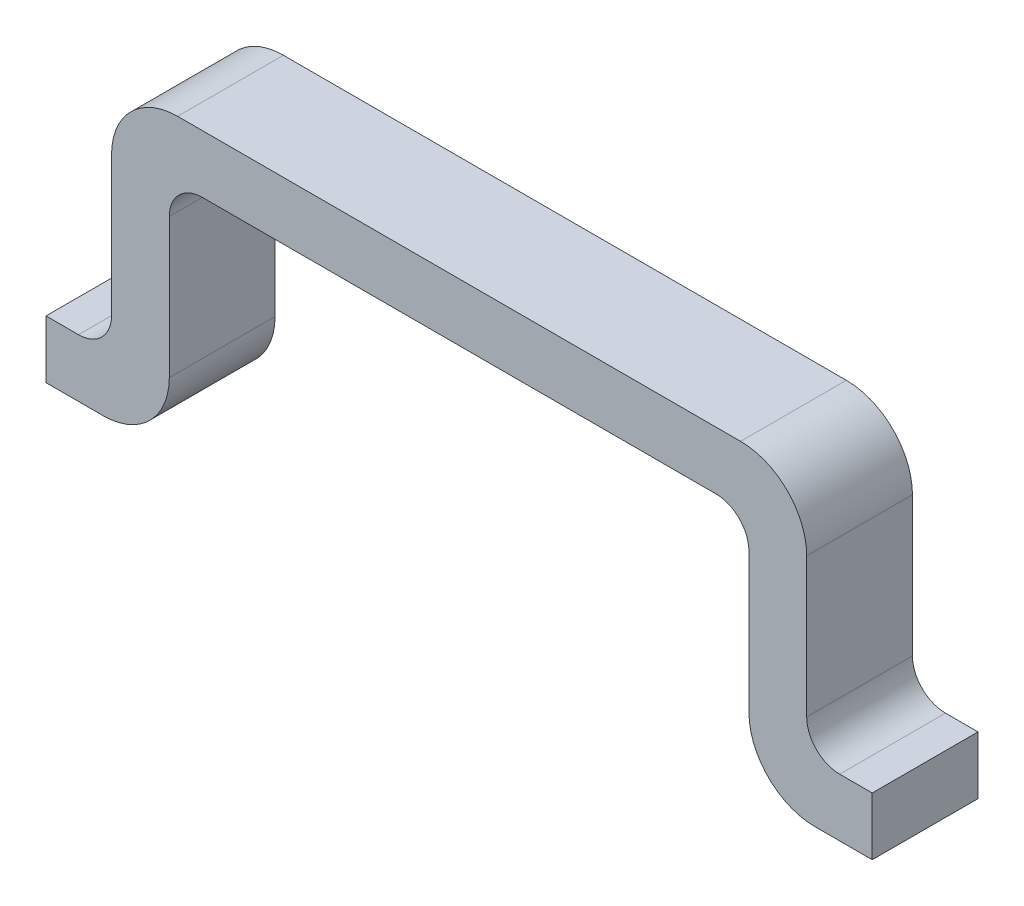
ISO-10303-21;
HEADER;
FILE_DESCRIPTION(('STEP AP214'),'2;1');
FILE_NAME('part.step','',(''),(''),'','','');
FILE_SCHEMA(('AUTOMOTIVE_DESIGN { 1 0 10303 214 1 1 1 1 }'));
ENDSEC;
DATA;
#1=APPLICATION_CONTEXT('core data for automotive mechanical design processes');
#2=APPLICATION_PROTOCOL_DEFINITION('international standard','automotive_design',2000,#1);
#3=PRODUCT_CONTEXT('',#1,'mechanical');
#4=PRODUCT('Part','Part','',(#3));
#5=PRODUCT_RELATED_PRODUCT_CATEGORY('part','',(#4));
#6=PRODUCT_DEFINITION_FORMATION('','',#4);
#7=PRODUCT_DEFINITION_CONTEXT('part definition',#1,'design');
#8=PRODUCT_DEFINITION('design','',#6,#7);
#9=PRODUCT_DEFINITION_SHAPE('','',#8);
#10=(LENGTH_UNIT() NAMED_UNIT(*) SI_UNIT(.MILLI.,.METRE.));
#11=(NAMED_UNIT(*) PLANE_ANGLE_UNIT() SI_UNIT($,.RADIAN.));
#12=(NAMED_UNIT(*) SI_UNIT($,.STERADIAN.) SOLID_ANGLE_UNIT());
#13=UNCERTAINTY_MEASURE_WITH_UNIT(LENGTH_MEASURE(1.E-05),#10,'distance_accuracy_value','');
#14=(GEOMETRIC_REPRESENTATION_CONTEXT(3) GLOBAL_UNCERTAINTY_ASSIGNED_CONTEXT((#13)) GLOBAL_UNIT_ASSIGNED_CONTEXT((#10,
#11,#12)) REPRESENTATION_CONTEXT('',''));
#15=CARTESIAN_POINT('',(0.,0.,0.));
#16=DIRECTION('',(0.,0.,1.));
#17=DIRECTION('',(1.,0.,0.));
#18=AXIS2_PLACEMENT_3D('',#15,#16,#17);
#19=CARTESIAN_POINT('',(0.964298577118,0.448602516384,0.16));
#20=DIRECTION('',(0.,0.,1.));
#21=DIRECTION('',(1.,0.,0.));
#22=AXIS2_PLACEMENT_3D('',#19,#20,#21);
#23=PLANE('',#22);
#24=CARTESIAN_POINT('',(1.151676163835,0.275,0.16));
#25=DIRECTION('',(0.,0.,1.));
#26=DIRECTION('',(1.,0.,0.));
#27=AXIS2_PLACEMENT_3D('',#24,#25,#26);
#28=CIRCLE('',#27,0.1);
#29=CARTESIAN_POINT('',(1.151676163835,0.175,0.16));
#30=VERTEX_POINT('',#29);
#31=CARTESIAN_POINT('',(1.051676163835,0.275,0.16));
#32=VERTEX_POINT('',#31);
#33=EDGE_CURVE('E215',#30,#32,#28,.F.);
#34=ORIENTED_EDGE('',*,*,#33,.T.);
#35=DIRECTION('',(0.,1.,0.));
#36=VECTOR('',#35,1.);
#37=CARTESIAN_POINT('',(1.051676163835,0.755,0.16));
#38=LINE('',#37,#36);
#39=CARTESIAN_POINT('',(1.051676163835,0.697205032768,0.16));
#40=VERTEX_POINT('',#39);
#41=EDGE_CURVE('E141',#40,#32,#38,.F.);
#42=ORIENTED_EDGE('',*,*,#41,.F.);
#43=CARTESIAN_POINT('',(0.851676163835,0.697205032768,0.16));
#44=DIRECTION('',(0.,0.,1.));
#45=DIRECTION('',(1.,0.,0.));
#46=AXIS2_PLACEMENT_3D('',#43,#44,#45);
#47=CIRCLE('',#46,0.2);
#48=CARTESIAN_POINT('',(0.851676163835,0.897205032768,0.16));
#49=VERTEX_POINT('',#48);
#50=EDGE_CURVE('E20',#49,#40,#47,.F.);
#51=ORIENTED_EDGE('',*,*,#50,.F.);
#52=DIRECTION('',(1.,0.,0.));
#53=VECTOR('',#52,1.);
#54=CARTESIAN_POINT('',(1.051676163835,0.897205032768,0.16));
#55=LINE('',#54,#53);
#56=CARTESIAN_POINT('',(-0.851676163835,0.897205032768,0.16));
#57=VERTEX_POINT('',#56);
#58=EDGE_CURVE('E139',#57,#49,#55,.T.);
#59=ORIENTED_EDGE('',*,*,#58,.F.);
#60=CARTESIAN_POINT('',(-0.851676163835,0.697205032768,0.16));
#61=DIRECTION('',(0.,0.,-1.));
#62=DIRECTION('',(-1.,0.,0.));
#63=AXIS2_PLACEMENT_3D('',#60,#61,#62);
#64=CIRCLE('',#63,0.2);
#65=CARTESIAN_POINT('',(-1.051676163835,0.697205032768,0.16));
#66=VERTEX_POINT('',#65);
#67=EDGE_CURVE('E244',#66,#57,#64,.T.);
#68=ORIENTED_EDGE('',*,*,#67,.F.);
#69=DIRECTION('',(0.,1.,0.));
#70=VECTOR('',#69,1.);
#71=CARTESIAN_POINT('',(-1.051676163835,0.755,0.16));
#72=LINE('',#71,#70);
#73=CARTESIAN_POINT('',(-1.051676163835,0.275,0.16));
#74=VERTEX_POINT('',#73);
#75=EDGE_CURVE('E161',#66,#74,#72,.F.);
#76=ORIENTED_EDGE('',*,*,#75,.T.);
#77=CARTESIAN_POINT('',(-1.151676163835,0.275,0.16));
#78=DIRECTION('',(0.,0.,-1.));
#79=DIRECTION('',(-1.,0.,0.));
#80=AXIS2_PLACEMENT_3D('',#77,#78,#79);
#81=CIRCLE('',#80,0.1);
#82=CARTESIAN_POINT('',(-1.151676163835,0.175,0.16));
#83=VERTEX_POINT('',#82);
#84=EDGE_CURVE('E246',#74,#83,#81,.T.);
#85=ORIENTED_EDGE('',*,*,#84,.T.);
#86=DIRECTION('',(1.,0.,0.));
#87=VECTOR('',#86,1.);
#88=CARTESIAN_POINT('',(-1.25,0.175,0.16));
#89=LINE('',#88,#87);
#90=CARTESIAN_POINT('',(-1.25,0.175,0.16));
#91=VERTEX_POINT('',#90);
#92=EDGE_CURVE('E165',#83,#91,#89,.F.);
#93=ORIENTED_EDGE('',*,*,#92,.T.);
#94=DIRECTION('',(0.,1.,0.));
#95=VECTOR('',#94,1.);
#96=CARTESIAN_POINT('',(-1.25,0.,0.16));
#97=LINE('',#96,#95);
#98=CARTESIAN_POINT('',(-1.25,0.,0.16));
#99=VERTEX_POINT('',#98);
#100=EDGE_CURVE('E172',#91,#99,#97,.F.);
#101=ORIENTED_EDGE('',*,*,#100,.T.);
#102=DIRECTION('',(1.,0.,0.));
#103=VECTOR('',#102,1.);
#104=CARTESIAN_POINT('',(-0.95,0.,0.16));
#105=LINE('',#104,#103);
#106=CARTESIAN_POINT('',(-1.076920990401,0.,0.16));
#107=VERTEX_POINT('',#106);
#108=EDGE_CURVE('E178',#99,#107,#105,.T.);
#109=ORIENTED_EDGE('',*,*,#108,.T.);
#110=CARTESIAN_POINT('',(-1.076920990401,0.2,0.16));
#111=DIRECTION('',(0.,0.,-1.));
#112=DIRECTION('',(-1.,0.,0.));
#113=AXIS2_PLACEMENT_3D('',#110,#111,#112);
#114=CIRCLE('',#113,0.2);
#115=CARTESIAN_POINT('',(-0.876920990401,0.2,0.16));
#116=VERTEX_POINT('',#115);
#117=EDGE_CURVE('E248',#116,#107,#114,.T.);
#118=ORIENTED_EDGE('',*,*,#117,.F.);
#119=DIRECTION('',(0.,1.,0.));
#120=VECTOR('',#119,1.);
#121=CARTESIAN_POINT('',(-0.876920990401,0.897205032768,0.16));
#122=LINE('',#121,#120);
#123=CARTESIAN_POINT('',(-0.876920990401,0.622205032768,0.16));
#124=VERTEX_POINT('',#123);
#125=EDGE_CURVE('E183',#116,#124,#122,.T.);
#126=ORIENTED_EDGE('',*,*,#125,.T.);
#127=CARTESIAN_POINT('',(-0.776920990401,0.622205032768,0.16));
#128=DIRECTION('',(0.,0.,1.));
#129=DIRECTION('',(1.,0.,0.));
#130=AXIS2_PLACEMENT_3D('',#127,#128,#129);
#131=CIRCLE('',#130,0.1);
#132=CARTESIAN_POINT('',(-0.776920990401,0.722205032768,0.16));
#133=VERTEX_POINT('',#132);
#134=EDGE_CURVE('E186',#124,#133,#131,.F.);
#135=ORIENTED_EDGE('',*,*,#134,.T.);
#136=DIRECTION('',(1.,0.,0.));
#137=VECTOR('',#136,1.);
#138=CARTESIAN_POINT('',(0.,0.722205032768,0.16));
#139=LINE('',#138,#137);
#140=CARTESIAN_POINT('',(0.776920990401,0.722205032768,0.16));
#141=VERTEX_POINT('',#140);
#142=EDGE_CURVE('E187',#141,#133,#139,.F.);
#143=ORIENTED_EDGE('',*,*,#142,.F.);
#144=CARTESIAN_POINT('',(0.776920990401,0.622205032768,0.16));
#145=DIRECTION('',(0.,0.,-1.));
#146=DIRECTION('',(-1.,0.,0.));
#147=AXIS2_PLACEMENT_3D('',#144,#145,#146);
#148=CIRCLE('',#147,0.1);
#149=CARTESIAN_POINT('',(0.876920990401,0.622205032768,0.16));
#150=VERTEX_POINT('',#149);
#151=EDGE_CURVE('E253',#141,#150,#148,.T.);
#152=ORIENTED_EDGE('',*,*,#151,.T.);
#153=DIRECTION('',(0.,1.,0.));
#154=VECTOR('',#153,1.);
#155=CARTESIAN_POINT('',(0.876920990401,0.897205032768,0.16));
#156=LINE('',#155,#154);
#157=CARTESIAN_POINT('',(0.876920990401,0.2,0.16));
#158=VERTEX_POINT('',#157);
#159=EDGE_CURVE('E191',#158,#150,#156,.T.);
#160=ORIENTED_EDGE('',*,*,#159,.F.);
#161=CARTESIAN_POINT('',(1.076920990401,0.2,0.16));
#162=DIRECTION('',(0.,0.,1.));
#163=DIRECTION('',(1.,0.,0.));
#164=AXIS2_PLACEMENT_3D('',#161,#162,#163);
#165=CIRCLE('',#164,0.2);
#166=CARTESIAN_POINT('',(1.076920990401,0.,0.16));
#167=VERTEX_POINT('',#166);
#168=EDGE_CURVE('E198',#167,#158,#165,.F.);
#169=ORIENTED_EDGE('',*,*,#168,.F.);
#170=DIRECTION('',(1.,0.,0.));
#171=VECTOR('',#170,1.);
#172=CARTESIAN_POINT('',(0.95,0.,0.16));
#173=LINE('',#172,#171);
#174=CARTESIAN_POINT('',(1.25,0.,0.16));
#175=VERTEX_POINT('',#174);
#176=EDGE_CURVE('E195',#175,#167,#173,.F.);
#177=ORIENTED_EDGE('',*,*,#176,.F.);
#178=DIRECTION('',(0.,1.,0.));
#179=VECTOR('',#178,1.);
#180=CARTESIAN_POINT('',(1.25,0.,0.16));
#181=LINE('',#180,#179);
#182=CARTESIAN_POINT('',(1.25,0.175,0.16));
#183=VERTEX_POINT('',#182);
#184=EDGE_CURVE('E202',#183,#175,#181,.F.);
#185=ORIENTED_EDGE('',*,*,#184,.F.);
#186=DIRECTION('',(-1.,0.,0.));
#187=VECTOR('',#186,1.);
#188=CARTESIAN_POINT('',(1.25,0.175,0.16));
#189=LINE('',#188,#187);
#190=EDGE_CURVE('E208',#30,#183,#189,.F.);
#191=ORIENTED_EDGE('',*,*,#190,.F.);
#192=EDGE_LOOP('',(#34,#42,#51,#59,#68,#76,#85,#93,#101,#109,#118,#126,#135,#143,#152,#160,#169,
#177,#185,#191));
#193=FACE_BOUND('',#192,.T.);
#194=ADVANCED_FACE('F17',(#193),#23,.T.);
#195=CARTESIAN_POINT('',(0.851676163835,0.697205032768,0.));
#196=DIRECTION('',(0.,0.,1.));
#197=DIRECTION('',(1.,0.,0.));
#198=AXIS2_PLACEMENT_3D('',#195,#196,#197);
#199=CYLINDRICAL_SURFACE('',#198,0.2);
#200=CARTESIAN_POINT('',(0.851676163835,0.697205032768,-0.16));
#201=DIRECTION('',(0.,0.,1.));
#202=DIRECTION('',(1.,0.,0.));
#203=AXIS2_PLACEMENT_3D('',#200,#201,#202);
#204=CIRCLE('',#203,0.2);
#205=CARTESIAN_POINT('',(0.851676163835,0.897205032768,-0.16));
#206=VERTEX_POINT('',#205);
#207=CARTESIAN_POINT('',(1.051676163835,0.697205032768,-0.16));
#208=VERTEX_POINT('',#207);
#209=EDGE_CURVE('E149',#206,#208,#204,.F.);
#210=ORIENTED_EDGE('',*,*,#209,.F.);
#211=DIRECTION('',(0.,0.,1.));
#212=VECTOR('',#211,1.);
#213=CARTESIAN_POINT('',(0.851676163835,0.897205032768,0.));
#214=LINE('',#213,#212);
#215=EDGE_CURVE('E146',#49,#206,#214,.F.);
#216=ORIENTED_EDGE('',*,*,#215,.F.);
#217=ORIENTED_EDGE('',*,*,#50,.T.);
#218=DIRECTION('',(0.,0.,-1.));
#219=VECTOR('',#218,1.);
#220=CARTESIAN_POINT('',(1.051676163835,0.697205032768,0.));
#221=LINE('',#220,#219);
#222=EDGE_CURVE('E144',#208,#40,#221,.F.);
#223=ORIENTED_EDGE('',*,*,#222,.F.);
#224=EDGE_LOOP('',(#210,#216,#217,#223));
#225=FACE_BOUND('',#224,.T.);
#226=ADVANCED_FACE('F147',(#225),#199,.T.);
#227=CARTESIAN_POINT('',(1.051676163835,0.755,0.));
#228=DIRECTION('',(1.,0.,0.));
#229=DIRECTION('',(0.,0.,-1.));
#230=AXIS2_PLACEMENT_3D('',#227,#228,#229);
#231=PLANE('',#230);
#232=ORIENTED_EDGE('',*,*,#222,.T.);
#233=ORIENTED_EDGE('',*,*,#41,.T.);
#234=DIRECTION('',(0.,0.,1.));
#235=VECTOR('',#234,1.);
#236=CARTESIAN_POINT('',(1.051676163835,0.275,0.));
#237=LINE('',#236,#235);
#238=CARTESIAN_POINT('',(1.051676163835,0.275,-0.16));
#239=VERTEX_POINT('',#238);
#240=EDGE_CURVE('E257',#32,#239,#237,.F.);
#241=ORIENTED_EDGE('',*,*,#240,.T.);
#242=DIRECTION('',(0.,1.,0.));
#243=VECTOR('',#242,1.);
#244=CARTESIAN_POINT('',(1.051676163835,0.448602516384,-0.16));
#245=LINE('',#244,#243);
#246=EDGE_CURVE('E155',#208,#239,#245,.F.);
#247=ORIENTED_EDGE('',*,*,#246,.F.);
#248=EDGE_LOOP('',(#232,#233,#241,#247));
#249=FACE_BOUND('',#248,.T.);
#250=ADVANCED_FACE('F524',(#249),#231,.T.);
#251=CARTESIAN_POINT('',(1.151676163835,0.275,0.));
#252=DIRECTION('',(0.,0.,1.));
#253=DIRECTION('',(1.,0.,0.));
#254=AXIS2_PLACEMENT_3D('',#251,#252,#253);
#255=CYLINDRICAL_SURFACE('',#254,0.1);
#256=ORIENTED_EDGE('',*,*,#240,.F.);
#257=ORIENTED_EDGE('',*,*,#33,.F.);
#258=DIRECTION('',(0.,0.,1.));
#259=VECTOR('',#258,1.);
#260=CARTESIAN_POINT('',(1.151676163835,0.175,0.));
#261=LINE('',#260,#259);
#262=CARTESIAN_POINT('',(1.151676163835,0.175,-0.16));
#263=VERTEX_POINT('',#262);
#264=EDGE_CURVE('E211',#263,#30,#261,.T.);
#265=ORIENTED_EDGE('',*,*,#264,.F.);
#266=CARTESIAN_POINT('',(1.151676163835,0.275,-0.16));
#267=DIRECTION('',(0.,0.,1.));
#268=DIRECTION('',(1.,0.,0.));
#269=AXIS2_PLACEMENT_3D('',#266,#267,#268);
#270=CIRCLE('',#269,0.1);
#271=EDGE_CURVE('E240',#239,#263,#270,.T.);
#272=ORIENTED_EDGE('',*,*,#271,.F.);
#273=EDGE_LOOP('',(#256,#257,#265,#272));
#274=FACE_BOUND('',#273,.T.);
#275=ADVANCED_FACE('F514',(#274),#255,.F.);
#276=CARTESIAN_POINT('',(1.25,0.175,0.));
#277=DIRECTION('',(0.,1.,0.));
#278=DIRECTION('',(-1.,0.,0.));
#279=AXIS2_PLACEMENT_3D('',#276,#277,#278);
#280=PLANE('',#279);
#281=DIRECTION('',(0.,0.,1.));
#282=VECTOR('',#281,1.);
#283=CARTESIAN_POINT('',(1.25,0.175,0.));
#284=LINE('',#283,#282);
#285=CARTESIAN_POINT('',(1.25,0.175,-0.16));
#286=VERTEX_POINT('',#285);
#287=EDGE_CURVE('E205',#286,#183,#284,.T.);
#288=ORIENTED_EDGE('',*,*,#287,.F.);
#289=DIRECTION('',(-1.,0.,0.));
#290=VECTOR('',#289,1.);
#291=CARTESIAN_POINT('',(0.964298577118,0.175,-0.16));
#292=LINE('',#291,#290);
#293=EDGE_CURVE('E242',#263,#286,#292,.F.);
#294=ORIENTED_EDGE('',*,*,#293,.F.);
#295=ORIENTED_EDGE('',*,*,#264,.T.);
#296=ORIENTED_EDGE('',*,*,#190,.T.);
#297=EDGE_LOOP('',(#288,#294,#295,#296));
#298=FACE_BOUND('',#297,.T.);
#299=ADVANCED_FACE('F504',(#298),#280,.T.);
#300=CARTESIAN_POINT('',(1.25,0.,0.));
#301=DIRECTION('',(1.,0.,0.));
#302=DIRECTION('',(0.,1.,0.));
#303=AXIS2_PLACEMENT_3D('',#300,#301,#302);
#304=PLANE('',#303);
#305=DIRECTION('',(0.,0.,-1.));
#306=VECTOR('',#305,1.);
#307=CARTESIAN_POINT('',(1.25,0.,0.));
#308=LINE('',#307,#306);
#309=CARTESIAN_POINT('',(1.25,0.,-0.16));
#310=VERTEX_POINT('',#309);
#311=EDGE_CURVE('E199',#310,#175,#308,.F.);
#312=ORIENTED_EDGE('',*,*,#311,.F.);
#313=DIRECTION('',(0.,1.,0.));
#314=VECTOR('',#313,1.);
#315=CARTESIAN_POINT('',(1.25,0.448602516384,-0.16));
#316=LINE('',#315,#314);
#317=EDGE_CURVE('E272',#286,#310,#316,.F.);
#318=ORIENTED_EDGE('',*,*,#317,.F.);
#319=ORIENTED_EDGE('',*,*,#287,.T.);
#320=ORIENTED_EDGE('',*,*,#184,.T.);
#321=EDGE_LOOP('',(#312,#318,#319,#320));
#322=FACE_BOUND('',#321,.T.);
#323=ADVANCED_FACE('F494',(#322),#304,.T.);
#324=CARTESIAN_POINT('',(0.95,0.,0.));
#325=DIRECTION('',(0.,-1.,0.));
#326=DIRECTION('',(0.,0.,-1.));
#327=AXIS2_PLACEMENT_3D('',#324,#325,#326);
#328=PLANE('',#327);
#329=ORIENTED_EDGE('',*,*,#311,.T.);
#330=ORIENTED_EDGE('',*,*,#176,.T.);
#331=DIRECTION('',(0.,0.,1.));
#332=VECTOR('',#331,1.);
#333=CARTESIAN_POINT('',(1.076920990401,0.,0.));
#334=LINE('',#333,#332);
#335=CARTESIAN_POINT('',(1.076920990401,0.,-0.16));
#336=VERTEX_POINT('',#335);
#337=EDGE_CURVE('E256',#336,#167,#334,.T.);
#338=ORIENTED_EDGE('',*,*,#337,.F.);
#339=DIRECTION('',(-1.,0.,0.));
#340=VECTOR('',#339,1.);
#341=CARTESIAN_POINT('',(0.964298577118,0.,-0.16));
#342=LINE('',#341,#340);
#343=EDGE_CURVE('E239',#310,#336,#342,.T.);
#344=ORIENTED_EDGE('',*,*,#343,.F.);
#345=EDGE_LOOP('',(#329,#330,#338,#344));
#346=FACE_BOUND('',#345,.T.);
#347=ADVANCED_FACE('F484',(#346),#328,.T.);
#348=CARTESIAN_POINT('',(1.076920990401,0.2,0.));
#349=DIRECTION('',(0.,0.,1.));
#350=DIRECTION('',(1.,0.,0.));
#351=AXIS2_PLACEMENT_3D('',#348,#349,#350);
#352=CYLINDRICAL_SURFACE('',#351,0.2);
#353=CARTESIAN_POINT('',(1.076920990401,0.2,-0.16));
#354=DIRECTION('',(0.,0.,1.));
#355=DIRECTION('',(1.,0.,0.));
#356=AXIS2_PLACEMENT_3D('',#353,#354,#355);
#357=CIRCLE('',#356,0.2);
#358=CARTESIAN_POINT('',(0.876920990401,0.2,-0.16));
#359=VERTEX_POINT('',#358);
#360=EDGE_CURVE('E236',#336,#359,#357,.F.);
#361=ORIENTED_EDGE('',*,*,#360,.F.);
#362=ORIENTED_EDGE('',*,*,#337,.T.);
#363=ORIENTED_EDGE('',*,*,#168,.T.);
#364=DIRECTION('',(0.,0.,1.));
#365=VECTOR('',#364,1.);
#366=CARTESIAN_POINT('',(0.876920990401,0.2,0.));
#367=LINE('',#366,#365);
#368=EDGE_CURVE('E194',#359,#158,#367,.T.);
#369=ORIENTED_EDGE('',*,*,#368,.F.);
#370=EDGE_LOOP('',(#361,#362,#363,#369));
#371=FACE_BOUND('',#370,.T.);
#372=ADVANCED_FACE('F474',(#371),#352,.T.);
#373=CARTESIAN_POINT('',(0.876920990401,0.897205032768,0.));
#374=DIRECTION('',(-1.,0.,0.));
#375=DIRECTION('',(0.,0.,1.));
#376=AXIS2_PLACEMENT_3D('',#373,#374,#375);
#377=PLANE('',#376);
#378=ORIENTED_EDGE('',*,*,#368,.T.);
#379=ORIENTED_EDGE('',*,*,#159,.T.);
#380=DIRECTION('',(0.,0.,-1.));
#381=VECTOR('',#380,1.);
#382=CARTESIAN_POINT('',(0.876920990401,0.622205032768,0.));
#383=LINE('',#382,#381);
#384=CARTESIAN_POINT('',(0.876920990401,0.622205032768,-0.16));
#385=VERTEX_POINT('',#384);
#386=EDGE_CURVE('E193',#150,#385,#383,.T.);
#387=ORIENTED_EDGE('',*,*,#386,.T.);
#388=DIRECTION('',(0.,1.,0.));
#389=VECTOR('',#388,1.);
#390=CARTESIAN_POINT('',(0.876920990401,0.448602516384,-0.16));
#391=LINE('',#390,#389);
#392=EDGE_CURVE('E235',#359,#385,#391,.T.);
#393=ORIENTED_EDGE('',*,*,#392,.F.);
#394=EDGE_LOOP('',(#378,#379,#387,#393));
#395=FACE_BOUND('',#394,.T.);
#396=ADVANCED_FACE('F464',(#395),#377,.T.);
#397=CARTESIAN_POINT('',(0.776920990401,0.622205032768,0.));
#398=DIRECTION('',(0.,0.,-1.));
#399=DIRECTION('',(-1.,0.,0.));
#400=AXIS2_PLACEMENT_3D('',#397,#398,#399);
#401=CYLINDRICAL_SURFACE('',#400,0.1);
#402=DIRECTION('',(0.,0.,1.));
#403=VECTOR('',#402,1.);
#404=CARTESIAN_POINT('',(0.776920990401,0.722205032768,0.));
#405=LINE('',#404,#403);
#406=CARTESIAN_POINT('',(0.776920990401,0.722205032768,-0.16));
#407=VERTEX_POINT('',#406);
#408=EDGE_CURVE('E190',#407,#141,#405,.T.);
#409=ORIENTED_EDGE('',*,*,#408,.F.);
#410=CARTESIAN_POINT('',(0.776920990401,0.622205032768,-0.16));
#411=DIRECTION('',(0.,0.,-1.));
#412=DIRECTION('',(-1.,0.,0.));
#413=AXIS2_PLACEMENT_3D('',#410,#411,#412);
#414=CIRCLE('',#413,0.1);
#415=EDGE_CURVE('E232',#385,#407,#414,.F.);
#416=ORIENTED_EDGE('',*,*,#415,.F.);
#417=ORIENTED_EDGE('',*,*,#386,.F.);
#418=ORIENTED_EDGE('',*,*,#151,.F.);
#419=EDGE_LOOP('',(#409,#416,#417,#418));
#420=FACE_BOUND('',#419,.T.);
#421=ADVANCED_FACE('F454',(#420),#401,.F.);
#422=CARTESIAN_POINT('',(0.,0.722205032768,0.));
#423=DIRECTION('',(0.,-1.,0.));
#424=DIRECTION('',(1.,0.,0.));
#425=AXIS2_PLACEMENT_3D('',#422,#423,#424);
#426=PLANE('',#425);
#427=DIRECTION('',(0.,0.,1.));
#428=VECTOR('',#427,1.);
#429=CARTESIAN_POINT('',(-0.776920990401,0.722205032768,0.));
#430=LINE('',#429,#428);
#431=CARTESIAN_POINT('',(-0.776920990401,0.722205032768,-0.16));
#432=VERTEX_POINT('',#431);
#433=EDGE_CURVE('E189',#133,#432,#430,.F.);
#434=ORIENTED_EDGE('',*,*,#433,.T.);
#435=DIRECTION('',(-1.,0.,0.));
#436=VECTOR('',#435,1.);
#437=CARTESIAN_POINT('',(0.964298577118,0.722205032768,-0.16));
#438=LINE('',#437,#436);
#439=EDGE_CURVE('E231',#407,#432,#438,.T.);
#440=ORIENTED_EDGE('',*,*,#439,.F.);
#441=ORIENTED_EDGE('',*,*,#408,.T.);
#442=ORIENTED_EDGE('',*,*,#142,.T.);
#443=EDGE_LOOP('',(#434,#440,#441,#442));
#444=FACE_BOUND('',#443,.T.);
#445=ADVANCED_FACE('F444',(#444),#426,.T.);
#446=CARTESIAN_POINT('',(-0.776920990401,0.622205032768,0.));
#447=DIRECTION('',(0.,0.,1.));
#448=DIRECTION('',(1.,0.,0.));
#449=AXIS2_PLACEMENT_3D('',#446,#447,#448);
#450=CYLINDRICAL_SURFACE('',#449,0.1);
#451=DIRECTION('',(0.,0.,1.));
#452=VECTOR('',#451,1.);
#453=CARTESIAN_POINT('',(-0.876920990401,0.622205032768,0.));
#454=LINE('',#453,#452);
#455=CARTESIAN_POINT('',(-0.876920990401,0.622205032768,-0.16));
#456=VERTEX_POINT('',#455);
#457=EDGE_CURVE('E185',#124,#456,#454,.F.);
#458=ORIENTED_EDGE('',*,*,#457,.T.);
#459=CARTESIAN_POINT('',(-0.776920990401,0.622205032768,-0.16));
#460=DIRECTION('',(0.,0.,1.));
#461=DIRECTION('',(1.,0.,0.));
#462=AXIS2_PLACEMENT_3D('',#459,#460,#461);
#463=CIRCLE('',#462,0.1);
#464=EDGE_CURVE('E228',#432,#456,#463,.T.);
#465=ORIENTED_EDGE('',*,*,#464,.F.);
#466=ORIENTED_EDGE('',*,*,#433,.F.);
#467=ORIENTED_EDGE('',*,*,#134,.F.);
#468=EDGE_LOOP('',(#458,#465,#466,#467));
#469=FACE_BOUND('',#468,.T.);
#470=ADVANCED_FACE('F434',(#469),#450,.F.);
#471=CARTESIAN_POINT('',(-0.876920990401,0.897205032768,0.));
#472=DIRECTION('',(-1.,0.,0.));
#473=DIRECTION('',(0.,0.,1.));
#474=AXIS2_PLACEMENT_3D('',#471,#472,#473);
#475=PLANE('',#474);
#476=ORIENTED_EDGE('',*,*,#125,.F.);
#477=DIRECTION('',(0.,0.,-1.));
#478=VECTOR('',#477,1.);
#479=CARTESIAN_POINT('',(-0.876920990401,0.2,0.));
#480=LINE('',#479,#478);
#481=CARTESIAN_POINT('',(-0.876920990401,0.2,-0.16));
#482=VERTEX_POINT('',#481);
#483=EDGE_CURVE('E180',#482,#116,#480,.F.);
#484=ORIENTED_EDGE('',*,*,#483,.F.);
#485=DIRECTION('',(0.,1.,0.));
#486=VECTOR('',#485,1.);
#487=CARTESIAN_POINT('',(-0.876920990401,0.448602516384,-0.16));
#488=LINE('',#487,#486);
#489=EDGE_CURVE('E227',#456,#482,#488,.F.);
#490=ORIENTED_EDGE('',*,*,#489,.F.);
#491=ORIENTED_EDGE('',*,*,#457,.F.);
#492=EDGE_LOOP('',(#476,#484,#490,#491));
#493=FACE_BOUND('',#492,.T.);
#494=ADVANCED_FACE('F424',(#493),#475,.F.);
#495=CARTESIAN_POINT('',(-1.076920990401,0.2,0.));
#496=DIRECTION('',(0.,0.,-1.));
#497=DIRECTION('',(-1.,0.,0.));
#498=AXIS2_PLACEMENT_3D('',#495,#496,#497);
#499=CYLINDRICAL_SURFACE('',#498,0.2);
#500=CARTESIAN_POINT('',(-1.076920990401,0.2,-0.16));
#501=DIRECTION('',(0.,0.,-1.));
#502=DIRECTION('',(-1.,0.,0.));
#503=AXIS2_PLACEMENT_3D('',#500,#501,#502);
#504=CIRCLE('',#503,0.2);
#505=CARTESIAN_POINT('',(-1.076920990401,0.,-0.16));
#506=VERTEX_POINT('',#505);
#507=EDGE_CURVE('E223',#482,#506,#504,.T.);
#508=ORIENTED_EDGE('',*,*,#507,.F.);
#509=ORIENTED_EDGE('',*,*,#483,.T.);
#510=ORIENTED_EDGE('',*,*,#117,.T.);
#511=DIRECTION('',(0.,0.,1.));
#512=VECTOR('',#511,1.);
#513=CARTESIAN_POINT('',(-1.076920990401,0.,0.));
#514=LINE('',#513,#512);
#515=EDGE_CURVE('E175',#107,#506,#514,.F.);
#516=ORIENTED_EDGE('',*,*,#515,.T.);
#517=EDGE_LOOP('',(#508,#509,#510,#516));
#518=FACE_BOUND('',#517,.T.);
#519=ADVANCED_FACE('F414',(#518),#499,.T.);
#520=CARTESIAN_POINT('',(-0.95,0.,0.));
#521=DIRECTION('',(0.,1.,0.));
#522=DIRECTION('',(0.,0.,1.));
#523=AXIS2_PLACEMENT_3D('',#520,#521,#522);
#524=PLANE('',#523);
#525=ORIENTED_EDGE('',*,*,#108,.F.);
#526=DIRECTION('',(0.,0.,1.));
#527=VECTOR('',#526,1.);
#528=CARTESIAN_POINT('',(-1.25,0.,0.));
#529=LINE('',#528,#527);
#530=CARTESIAN_POINT('',(-1.25,0.,-0.16));
#531=VERTEX_POINT('',#530);
#532=EDGE_CURVE('E169',#99,#531,#529,.F.);
#533=ORIENTED_EDGE('',*,*,#532,.T.);
#534=DIRECTION('',(-1.,0.,0.));
#535=VECTOR('',#534,1.);
#536=CARTESIAN_POINT('',(0.964298577118,0.,-0.16));
#537=LINE('',#536,#535);
#538=EDGE_CURVE('E226',#506,#531,#537,.T.);
#539=ORIENTED_EDGE('',*,*,#538,.F.);
#540=ORIENTED_EDGE('',*,*,#515,.F.);
#541=EDGE_LOOP('',(#525,#533,#539,#540));
#542=FACE_BOUND('',#541,.T.);
#543=ADVANCED_FACE('F404',(#542),#524,.F.);
#544=CARTESIAN_POINT('',(-1.25,0.,0.));
#545=DIRECTION('',(1.,0.,0.));
#546=DIRECTION('',(0.,1.,0.));
#547=AXIS2_PLACEMENT_3D('',#544,#545,#546);
#548=PLANE('',#547);
#549=DIRECTION('',(0.,1.,0.));
#550=VECTOR('',#549,1.);
#551=CARTESIAN_POINT('',(-1.25,0.448602516384,-0.16));
#552=LINE('',#551,#550);
#553=CARTESIAN_POINT('',(-1.25,0.175,-0.16));
#554=VERTEX_POINT('',#553);
#555=EDGE_CURVE('E297',#531,#554,#552,.T.);
#556=ORIENTED_EDGE('',*,*,#555,.F.);
#557=ORIENTED_EDGE('',*,*,#532,.F.);
#558=ORIENTED_EDGE('',*,*,#100,.F.);
#559=DIRECTION('',(0.,0.,1.));
#560=VECTOR('',#559,1.);
#561=CARTESIAN_POINT('',(-1.25,0.175,0.));
#562=LINE('',#561,#560);
#563=EDGE_CURVE('E168',#91,#554,#562,.F.);
#564=ORIENTED_EDGE('',*,*,#563,.T.);
#565=EDGE_LOOP('',(#556,#557,#558,#564));
#566=FACE_BOUND('',#565,.T.);
#567=ADVANCED_FACE('F394',(#566),#548,.F.);
#568=CARTESIAN_POINT('',(-1.25,0.175,0.));
#569=DIRECTION('',(0.,-1.,0.));
#570=DIRECTION('',(1.,0.,0.));
#571=AXIS2_PLACEMENT_3D('',#568,#569,#570);
#572=PLANE('',#571);
#573=DIRECTION('',(-1.,0.,0.));
#574=VECTOR('',#573,1.);
#575=CARTESIAN_POINT('',(0.964298577118,0.175,-0.16));
#576=LINE('',#575,#574);
#577=CARTESIAN_POINT('',(-1.151676163835,0.175,-0.16));
#578=VERTEX_POINT('',#577);
#579=EDGE_CURVE('E222',#554,#578,#576,.F.);
#580=ORIENTED_EDGE('',*,*,#579,.F.);
#581=ORIENTED_EDGE('',*,*,#563,.F.);
#582=ORIENTED_EDGE('',*,*,#92,.F.);
#583=DIRECTION('',(0.,0.,-1.));
#584=VECTOR('',#583,1.);
#585=CARTESIAN_POINT('',(-1.151676163835,0.175,0.));
#586=LINE('',#585,#584);
#587=EDGE_CURVE('E164',#83,#578,#586,.T.);
#588=ORIENTED_EDGE('',*,*,#587,.T.);
#589=EDGE_LOOP('',(#580,#581,#582,#588));
#590=FACE_BOUND('',#589,.T.);
#591=ADVANCED_FACE('F384',(#590),#572,.F.);
#592=CARTESIAN_POINT('',(-1.151676163835,0.275,0.));
#593=DIRECTION('',(0.,0.,-1.));
#594=DIRECTION('',(-1.,0.,0.));
#595=AXIS2_PLACEMENT_3D('',#592,#593,#594);
#596=CYLINDRICAL_SURFACE('',#595,0.1);
#597=ORIENTED_EDGE('',*,*,#587,.F.);
#598=ORIENTED_EDGE('',*,*,#84,.F.);
#599=DIRECTION('',(0.,0.,-1.));
#600=VECTOR('',#599,1.);
#601=CARTESIAN_POINT('',(-1.051676163835,0.275,0.));
#602=LINE('',#601,#600);
#603=CARTESIAN_POINT('',(-1.051676163835,0.275,-0.16));
#604=VERTEX_POINT('',#603);
#605=EDGE_CURVE('E163',#74,#604,#602,.T.);
#606=ORIENTED_EDGE('',*,*,#605,.T.);
#607=CARTESIAN_POINT('',(-1.151676163835,0.275,-0.16));
#608=DIRECTION('',(0.,0.,-1.));
#609=DIRECTION('',(-1.,0.,0.));
#610=AXIS2_PLACEMENT_3D('',#607,#608,#609);
#611=CIRCLE('',#610,0.1);
#612=EDGE_CURVE('E219',#578,#604,#611,.F.);
#613=ORIENTED_EDGE('',*,*,#612,.F.);
#614=EDGE_LOOP('',(#597,#598,#606,#613));
#615=FACE_BOUND('',#614,.T.);
#616=ADVANCED_FACE('F350',(#615),#596,.F.);
#617=CARTESIAN_POINT('',(-1.051676163835,0.755,0.));
#618=DIRECTION('',(1.,0.,0.));
#619=DIRECTION('',(0.,0.,-1.));
#620=AXIS2_PLACEMENT_3D('',#617,#618,#619);
#621=PLANE('',#620);
#622=ORIENTED_EDGE('',*,*,#75,.F.);
#623=DIRECTION('',(0.,0.,-1.));
#624=VECTOR('',#623,1.);
#625=CARTESIAN_POINT('',(-1.051676163835,0.697205032768,0.));
#626=LINE('',#625,#624);
#627=CARTESIAN_POINT('',(-1.051676163835,0.697205032768,-0.16));
#628=VERTEX_POINT('',#627);
#629=EDGE_CURVE('E151',#628,#66,#626,.F.);
#630=ORIENTED_EDGE('',*,*,#629,.F.);
#631=DIRECTION('',(0.,1.,0.));
#632=VECTOR('',#631,1.);
#633=CARTESIAN_POINT('',(-1.051676163835,0.448602516384,-0.16));
#634=LINE('',#633,#632);
#635=EDGE_CURVE('E218',#604,#628,#634,.T.);
#636=ORIENTED_EDGE('',*,*,#635,.F.);
#637=ORIENTED_EDGE('',*,*,#605,.F.);
#638=EDGE_LOOP('',(#622,#630,#636,#637));
#639=FACE_BOUND('',#638,.T.);
#640=ADVANCED_FACE('F340',(#639),#621,.F.);
#641=CARTESIAN_POINT('',(-0.851676163835,0.697205032768,0.));
#642=DIRECTION('',(0.,0.,-1.));
#643=DIRECTION('',(-1.,0.,0.));
#644=AXIS2_PLACEMENT_3D('',#641,#642,#643);
#645=CYLINDRICAL_SURFACE('',#644,0.2);
#646=CARTESIAN_POINT('',(-0.851676163835,0.697205032768,-0.16));
#647=DIRECTION('',(0.,0.,-1.));
#648=DIRECTION('',(-1.,0.,0.));
#649=AXIS2_PLACEMENT_3D('',#646,#647,#648);
#650=CIRCLE('',#649,0.2);
#651=CARTESIAN_POINT('',(-0.851676163835,0.897205032768,-0.16));
#652=VERTEX_POINT('',#651);
#653=EDGE_CURVE('E26',#628,#652,#650,.T.);
#654=ORIENTED_EDGE('',*,*,#653,.F.);
#655=ORIENTED_EDGE('',*,*,#629,.T.);
#656=ORIENTED_EDGE('',*,*,#67,.T.);
#657=DIRECTION('',(0.,0.,1.));
#658=VECTOR('',#657,1.);
#659=CARTESIAN_POINT('',(-0.851676163835,0.897205032768,0.));
#660=LINE('',#659,#658);
#661=EDGE_CURVE('E35',#652,#57,#660,.T.);
#662=ORIENTED_EDGE('',*,*,#661,.F.);
#663=EDGE_LOOP('',(#654,#655,#656,#662));
#664=FACE_BOUND('',#663,.T.);
#665=ADVANCED_FACE('F341',(#664),#645,.T.);
#666=CARTESIAN_POINT('',(1.051676163835,0.897205032768,0.));
#667=DIRECTION('',(0.,1.,0.));
#668=DIRECTION('',(0.,0.,1.));
#669=AXIS2_PLACEMENT_3D('',#666,#667,#668);
#670=PLANE('',#669);
#671=ORIENTED_EDGE('',*,*,#661,.T.);
#672=ORIENTED_EDGE('',*,*,#58,.T.);
#673=ORIENTED_EDGE('',*,*,#215,.T.);
#674=DIRECTION('',(-1.,0.,0.));
#675=VECTOR('',#674,1.);
#676=CARTESIAN_POINT('',(0.964298577118,0.897205032768,-0.16));
#677=LINE('',#676,#675);
#678=EDGE_CURVE('E11',#652,#206,#677,.F.);
#679=ORIENTED_EDGE('',*,*,#678,.F.);
#680=EDGE_LOOP('',(#671,#672,#673,#679));
#681=FACE_BOUND('',#680,.T.);
#682=ADVANCED_FACE('F153',(#681),#670,.T.);
#683=CARTESIAN_POINT('',(0.964298577118,0.448602516384,-0.16));
#684=DIRECTION('',(0.,0.,-1.));
#685=DIRECTION('',(-1.,0.,0.));
#686=AXIS2_PLACEMENT_3D('',#683,#684,#685);
#687=PLANE('',#686);
#688=ORIENTED_EDGE('',*,*,#653,.T.);
#689=ORIENTED_EDGE('',*,*,#678,.T.);
#690=ORIENTED_EDGE('',*,*,#209,.T.);
#691=ORIENTED_EDGE('',*,*,#246,.T.);
#692=ORIENTED_EDGE('',*,*,#271,.T.);
#693=ORIENTED_EDGE('',*,*,#293,.T.);
#694=ORIENTED_EDGE('',*,*,#317,.T.);
#695=ORIENTED_EDGE('',*,*,#343,.T.);
#696=ORIENTED_EDGE('',*,*,#360,.T.);
#697=ORIENTED_EDGE('',*,*,#392,.T.);
#698=ORIENTED_EDGE('',*,*,#415,.T.);
#699=ORIENTED_EDGE('',*,*,#439,.T.);
#700=ORIENTED_EDGE('',*,*,#464,.T.);
#701=ORIENTED_EDGE('',*,*,#489,.T.);
#702=ORIENTED_EDGE('',*,*,#507,.T.);
#703=ORIENTED_EDGE('',*,*,#538,.T.);
#704=ORIENTED_EDGE('',*,*,#555,.T.);
#705=ORIENTED_EDGE('',*,*,#579,.T.);
#706=ORIENTED_EDGE('',*,*,#612,.T.);
#707=ORIENTED_EDGE('',*,*,#635,.T.);
#708=EDGE_LOOP('',(#688,#689,#690,#691,#692,#693,#694,#695,#696,#697,#698,#699,#700,#701,#702,
#703,#704,#705,#706,#707));
#709=FACE_BOUND('',#708,.T.);
#710=ADVANCED_FACE('F335',(#709),#687,.T.);
#711=CLOSED_SHELL('',(#194,#226,#250,#275,#299,#323,#347,#372,#396,#421,#445,#470,#494,#519,
#543,#567,#591,#616,#640,#665,#682,#710));
#712=MANIFOLD_SOLID_BREP('B1',#711);
#713=ADVANCED_BREP_SHAPE_REPRESENTATION('',(#18,#712),#14);
#714=SHAPE_DEFINITION_REPRESENTATION(#9,#713);
ENDSEC;
END-ISO-10303-21;
